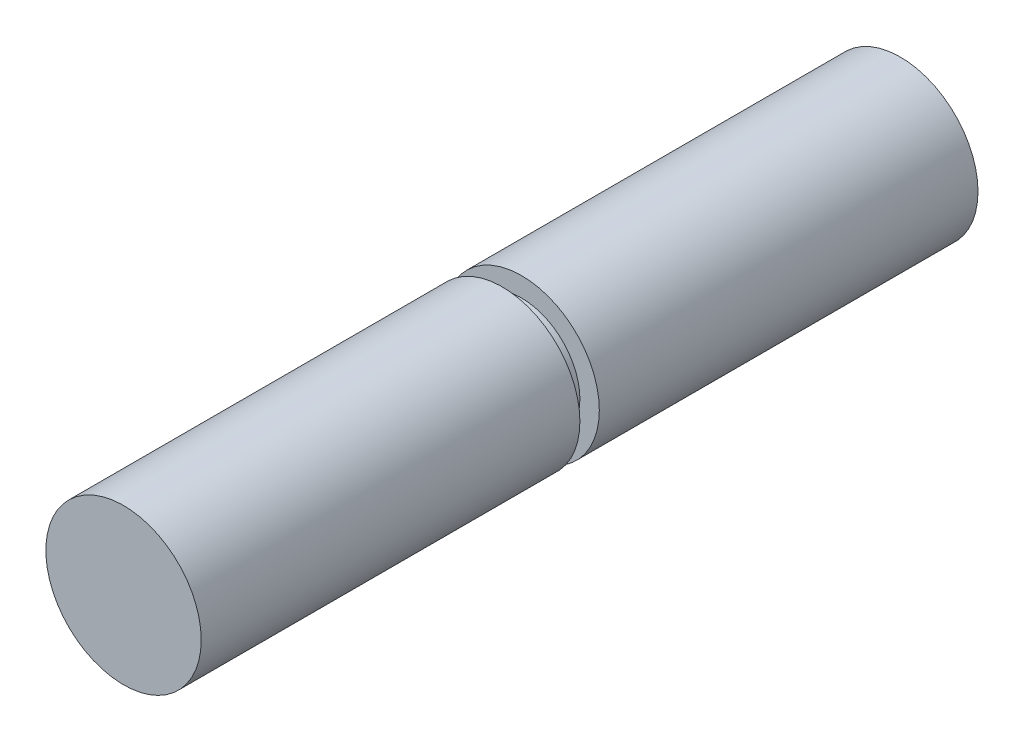
ISO-10303-21;
HEADER;
FILE_DESCRIPTION(('STEP AP214'),'2;1');
FILE_NAME('part.step','',(''),(''),'','','');
FILE_SCHEMA(('AUTOMOTIVE_DESIGN { 1 0 10303 214 1 1 1 1 }'));
ENDSEC;
DATA;
#1=APPLICATION_CONTEXT('core data for automotive mechanical design processes');
#2=APPLICATION_PROTOCOL_DEFINITION('international standard','automotive_design',2000,#1);
#3=PRODUCT_CONTEXT('',#1,'mechanical');
#4=PRODUCT('Part','Part','',(#3));
#5=PRODUCT_RELATED_PRODUCT_CATEGORY('part','',(#4));
#6=PRODUCT_DEFINITION_FORMATION('','',#4);
#7=PRODUCT_DEFINITION_CONTEXT('part definition',#1,'design');
#8=PRODUCT_DEFINITION('design','',#6,#7);
#9=PRODUCT_DEFINITION_SHAPE('','',#8);
#10=(LENGTH_UNIT() NAMED_UNIT(*) SI_UNIT(.MILLI.,.METRE.));
#11=(NAMED_UNIT(*) PLANE_ANGLE_UNIT() SI_UNIT($,.RADIAN.));
#12=(NAMED_UNIT(*) SI_UNIT($,.STERADIAN.) SOLID_ANGLE_UNIT());
#13=UNCERTAINTY_MEASURE_WITH_UNIT(LENGTH_MEASURE(1.E-05),#10,'distance_accuracy_value','');
#14=(GEOMETRIC_REPRESENTATION_CONTEXT(3) GLOBAL_UNCERTAINTY_ASSIGNED_CONTEXT((#13)) GLOBAL_UNIT_ASSIGNED_CONTEXT((#10,
#11,#12)) REPRESENTATION_CONTEXT('',''));
#15=CARTESIAN_POINT('',(0.,0.,0.));
#16=DIRECTION('',(0.,0.,1.));
#17=DIRECTION('',(1.,0.,0.));
#18=AXIS2_PLACEMENT_3D('',#15,#16,#17);
#19=CARTESIAN_POINT('',(0.,0.,127.));
#20=DIRECTION('',(0.,0.,-1.));
#21=DIRECTION('',(-1.,0.,0.));
#22=AXIS2_PLACEMENT_3D('',#19,#20,#21);
#23=CYLINDRICAL_SURFACE('',#22,25.4);
#24=CARTESIAN_POINT('',(0.,0.,-127.));
#25=DIRECTION('',(0.,0.,1.));
#26=DIRECTION('',(1.,0.,0.));
#27=AXIS2_PLACEMENT_3D('',#24,#25,#26);
#28=CIRCLE('',#27,25.4);
#29=CARTESIAN_POINT('',(25.4,0.,-127.));
#30=VERTEX_POINT('',#29);
#31=EDGE_CURVE('E34',#30,#30,#28,.T.);
#32=ORIENTED_EDGE('',*,*,#31,.T.);
#33=EDGE_LOOP('',(#32));
#34=FACE_BOUND('',#33,.T.);
#35=CARTESIAN_POINT('',(0.,0.,-3.17499999999998));
#36=DIRECTION('',(0.,0.,1.));
#37=DIRECTION('',(1.,0.,0.));
#38=AXIS2_PLACEMENT_3D('',#35,#36,#37);
#39=CIRCLE('',#38,25.4);
#40=CARTESIAN_POINT('',(25.4,0.,-3.17499999999998));
#41=VERTEX_POINT('',#40);
#42=EDGE_CURVE('E41',#41,#41,#39,.T.);
#43=ORIENTED_EDGE('',*,*,#42,.F.);
#44=EDGE_LOOP('',(#43));
#45=FACE_BOUND('',#44,.T.);
#46=ADVANCED_FACE('F31',(#34,#45),#23,.T.);
#47=CARTESIAN_POINT('',(0.,0.,-127.));
#48=DIRECTION('',(0.,0.,1.));
#49=DIRECTION('',(1.,0.,0.));
#50=AXIS2_PLACEMENT_3D('',#47,#48,#49);
#51=PLANE('',#50);
#52=ORIENTED_EDGE('',*,*,#31,.F.);
#53=EDGE_LOOP('',(#52));
#54=FACE_BOUND('',#53,.T.);
#55=ADVANCED_FACE('F61',(#54),#51,.F.);
#56=CARTESIAN_POINT('',(0.,25.4,-3.17499999999999));
#57=DIRECTION('',(0.,0.,1.));
#58=DIRECTION('',(1.,0.,0.));
#59=AXIS2_PLACEMENT_3D('',#56,#57,#58);
#60=PLANE('',#59);
#61=ORIENTED_EDGE('',*,*,#42,.T.);
#62=EDGE_LOOP('',(#61));
#63=FACE_BOUND('',#62,.T.);
#64=CARTESIAN_POINT('',(0.,0.,-3.17499999999998));
#65=DIRECTION('',(0.,0.,1.));
#66=DIRECTION('',(1.,0.,0.));
#67=AXIS2_PLACEMENT_3D('',#64,#65,#66);
#68=CIRCLE('',#67,19.05);
#69=CARTESIAN_POINT('',(19.05,0.,-3.17499999999998));
#70=VERTEX_POINT('',#69);
#71=EDGE_CURVE('E51',#70,#70,#68,.T.);
#72=ORIENTED_EDGE('',*,*,#71,.F.);
#73=EDGE_LOOP('',(#72));
#74=FACE_BOUND('',#73,.T.);
#75=ADVANCED_FACE('F58',(#63,#74),#60,.T.);
#76=CARTESIAN_POINT('',(0.,25.4,3.17500000000001));
#77=DIRECTION('',(0.,0.,-1.));
#78=DIRECTION('',(-1.,0.,0.));
#79=AXIS2_PLACEMENT_3D('',#76,#77,#78);
#80=PLANE('',#79);
#81=CARTESIAN_POINT('',(0.,0.,3.17500000000001));
#82=DIRECTION('',(0.,0.,1.));
#83=DIRECTION('',(1.,0.,0.));
#84=AXIS2_PLACEMENT_3D('',#81,#82,#83);
#85=CIRCLE('',#84,19.05);
#86=CARTESIAN_POINT('',(19.05,0.,3.17500000000001));
#87=VERTEX_POINT('',#86);
#88=EDGE_CURVE('E48',#87,#87,#85,.T.);
#89=ORIENTED_EDGE('',*,*,#88,.T.);
#90=EDGE_LOOP('',(#89));
#91=FACE_BOUND('',#90,.T.);
#92=CARTESIAN_POINT('',(0.,0.,3.17500000000001));
#93=DIRECTION('',(0.,0.,1.));
#94=DIRECTION('',(1.,0.,0.));
#95=AXIS2_PLACEMENT_3D('',#92,#93,#94);
#96=CIRCLE('',#95,25.4);
#97=CARTESIAN_POINT('',(25.4,0.,3.17500000000001));
#98=VERTEX_POINT('',#97);
#99=EDGE_CURVE('E45',#98,#98,#96,.T.);
#100=ORIENTED_EDGE('',*,*,#99,.F.);
#101=EDGE_LOOP('',(#100));
#102=FACE_BOUND('',#101,.T.);
#103=ADVANCED_FACE('F60',(#91,#102),#80,.T.);
#104=CARTESIAN_POINT('',(0.,0.,127.));
#105=DIRECTION('',(0.,0.,1.));
#106=DIRECTION('',(1.,0.,0.));
#107=AXIS2_PLACEMENT_3D('',#104,#105,#106);
#108=CYLINDRICAL_SURFACE('',#107,19.05);
#109=ORIENTED_EDGE('',*,*,#71,.T.);
#110=EDGE_LOOP('',(#109));
#111=FACE_BOUND('',#110,.T.);
#112=ORIENTED_EDGE('',*,*,#88,.F.);
#113=EDGE_LOOP('',(#112));
#114=FACE_BOUND('',#113,.T.);
#115=ADVANCED_FACE('F55',(#111,#114),#108,.T.);
#116=CARTESIAN_POINT('',(0.,0.,127.));
#117=DIRECTION('',(0.,0.,1.));
#118=DIRECTION('',(1.,0.,0.));
#119=AXIS2_PLACEMENT_3D('',#116,#117,#118);
#120=PLANE('',#119);
#121=CARTESIAN_POINT('',(0.,0.,127.));
#122=DIRECTION('',(0.,0.,1.));
#123=DIRECTION('',(1.,0.,0.));
#124=AXIS2_PLACEMENT_3D('',#121,#122,#123);
#125=CIRCLE('',#124,25.4);
#126=CARTESIAN_POINT('',(25.4,0.,127.));
#127=VERTEX_POINT('',#126);
#128=EDGE_CURVE('E10',#127,#127,#125,.T.);
#129=ORIENTED_EDGE('',*,*,#128,.T.);
#130=EDGE_LOOP('',(#129));
#131=FACE_BOUND('',#130,.T.);
#132=ADVANCED_FACE('F79',(#131),#120,.T.);
#133=ORIENTED_EDGE('',*,*,#128,.F.);
#134=EDGE_LOOP('',(#133));
#135=FACE_BOUND('',#134,.T.);
#136=ORIENTED_EDGE('',*,*,#99,.T.);
#137=EDGE_LOOP('',(#136));
#138=FACE_BOUND('',#137,.T.);
#139=ADVANCED_FACE('F74',(#135,#138),#23,.T.);
#140=CLOSED_SHELL('',(#46,#55,#75,#103,#115,#132,#139));
#141=MANIFOLD_SOLID_BREP('B2',#140);
#142=ADVANCED_BREP_SHAPE_REPRESENTATION('',(#18,#141),#14);
#143=SHAPE_DEFINITION_REPRESENTATION(#9,#142);
ENDSEC;
END-ISO-10303-21;
